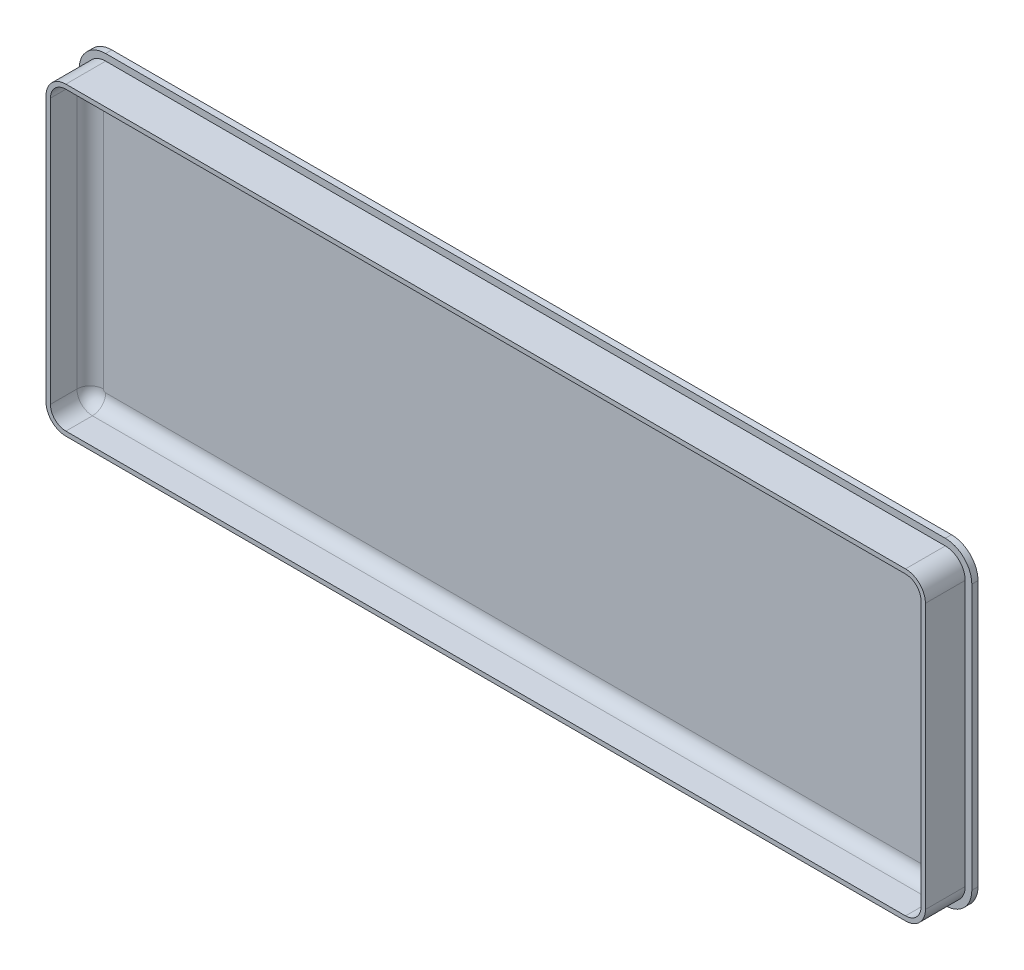
ISO-10303-21;
HEADER;
FILE_DESCRIPTION(('STEP AP214'),'2;1');
FILE_NAME('part.step','',(''),(''),'','','');
FILE_SCHEMA(('AUTOMOTIVE_DESIGN { 1 0 10303 214 1 1 1 1 }'));
ENDSEC;
DATA;
#1=APPLICATION_CONTEXT('core data for automotive mechanical design processes');
#2=APPLICATION_PROTOCOL_DEFINITION('international standard','automotive_design',2000,#1);
#3=PRODUCT_CONTEXT('',#1,'mechanical');
#4=PRODUCT('Part','Part','',(#3));
#5=PRODUCT_RELATED_PRODUCT_CATEGORY('part','',(#4));
#6=PRODUCT_DEFINITION_FORMATION('','',#4);
#7=PRODUCT_DEFINITION_CONTEXT('part definition',#1,'design');
#8=PRODUCT_DEFINITION('design','',#6,#7);
#9=PRODUCT_DEFINITION_SHAPE('','',#8);
#10=(LENGTH_UNIT() NAMED_UNIT(*) SI_UNIT(.MILLI.,.METRE.));
#11=(NAMED_UNIT(*) PLANE_ANGLE_UNIT() SI_UNIT($,.RADIAN.));
#12=(NAMED_UNIT(*) SI_UNIT($,.STERADIAN.) SOLID_ANGLE_UNIT());
#13=UNCERTAINTY_MEASURE_WITH_UNIT(LENGTH_MEASURE(1.E-05),#10,'distance_accuracy_value','');
#14=(GEOMETRIC_REPRESENTATION_CONTEXT(3) GLOBAL_UNCERTAINTY_ASSIGNED_CONTEXT((#13)) GLOBAL_UNIT_ASSIGNED_CONTEXT((#10,
#11,#12)) REPRESENTATION_CONTEXT('',''));
#15=CARTESIAN_POINT('',(0.,0.,0.));
#16=DIRECTION('',(0.,0.,1.));
#17=DIRECTION('',(1.,0.,0.));
#18=AXIS2_PLACEMENT_3D('',#15,#16,#17);
#19=CARTESIAN_POINT('',(0.,0.,1.4));
#20=DIRECTION('',(0.,0.,-1.));
#21=DIRECTION('',(-1.,0.,0.));
#22=AXIS2_PLACEMENT_3D('',#19,#20,#21);
#23=PLANE('',#22);
#24=DIRECTION('',(0.,1.,0.));
#25=VECTOR('',#24,1.);
#26=CARTESIAN_POINT('',(202.,0.,1.4));
#27=LINE('',#26,#25);
#28=CARTESIAN_POINT('',(202.,6.,1.4));
#29=VERTEX_POINT('',#28);
#30=CARTESIAN_POINT('',(202.,66.,1.4));
#31=VERTEX_POINT('',#30);
#32=EDGE_CURVE('E423',#29,#31,#27,.T.);
#33=ORIENTED_EDGE('',*,*,#32,.T.);
#34=CARTESIAN_POINT('',(196.,66.,1.4));
#35=DIRECTION('',(0.,0.,-1.));
#36=DIRECTION('',(-1.,0.,0.));
#37=AXIS2_PLACEMENT_3D('',#34,#35,#36);
#38=CIRCLE('',#37,6.);
#39=CARTESIAN_POINT('',(196.,72.,1.4));
#40=VERTEX_POINT('',#39);
#41=EDGE_CURVE('E317',#31,#40,#38,.F.);
#42=ORIENTED_EDGE('',*,*,#41,.T.);
#43=DIRECTION('',(-1.,0.,0.));
#44=VECTOR('',#43,1.);
#45=CARTESIAN_POINT('',(0.,72.,1.4));
#46=LINE('',#45,#44);
#47=CARTESIAN_POINT('',(6.,72.,1.4));
#48=VERTEX_POINT('',#47);
#49=EDGE_CURVE('E232',#40,#48,#46,.T.);
#50=ORIENTED_EDGE('',*,*,#49,.T.);
#51=CARTESIAN_POINT('',(6.,66.,1.4));
#52=DIRECTION('',(0.,0.,-1.));
#53=DIRECTION('',(-1.,0.,0.));
#54=AXIS2_PLACEMENT_3D('',#51,#52,#53);
#55=CIRCLE('',#54,6.);
#56=CARTESIAN_POINT('',(0.,66.,1.4));
#57=VERTEX_POINT('',#56);
#58=EDGE_CURVE('E313',#48,#57,#55,.F.);
#59=ORIENTED_EDGE('',*,*,#58,.T.);
#60=DIRECTION('',(0.,-1.,0.));
#61=VECTOR('',#60,1.);
#62=CARTESIAN_POINT('',(0.,0.,1.4));
#63=LINE('',#62,#61);
#64=CARTESIAN_POINT('',(0.,6.,1.4));
#65=VERTEX_POINT('',#64);
#66=EDGE_CURVE('E416',#57,#65,#63,.T.);
#67=ORIENTED_EDGE('',*,*,#66,.T.);
#68=CARTESIAN_POINT('',(6.,6.,1.4));
#69=DIRECTION('',(0.,0.,-1.));
#70=DIRECTION('',(-1.,0.,0.));
#71=AXIS2_PLACEMENT_3D('',#68,#69,#70);
#72=CIRCLE('',#71,6.);
#73=CARTESIAN_POINT('',(6.,0.,1.4));
#74=VERTEX_POINT('',#73);
#75=EDGE_CURVE('E311',#65,#74,#72,.F.);
#76=ORIENTED_EDGE('',*,*,#75,.T.);
#77=DIRECTION('',(1.,0.,0.));
#78=VECTOR('',#77,1.);
#79=CARTESIAN_POINT('',(0.,0.,1.4));
#80=LINE('',#79,#78);
#81=CARTESIAN_POINT('',(196.,0.,1.4));
#82=VERTEX_POINT('',#81);
#83=EDGE_CURVE('E419',#74,#82,#80,.T.);
#84=ORIENTED_EDGE('',*,*,#83,.T.);
#85=CARTESIAN_POINT('',(196.,6.,1.4));
#86=DIRECTION('',(0.,0.,-1.));
#87=DIRECTION('',(-1.,0.,0.));
#88=AXIS2_PLACEMENT_3D('',#85,#86,#87);
#89=CIRCLE('',#88,6.);
#90=EDGE_CURVE('E315',#82,#29,#89,.F.);
#91=ORIENTED_EDGE('',*,*,#90,.T.);
#92=EDGE_LOOP('',(#33,#42,#50,#59,#67,#76,#84,#91));
#93=FACE_BOUND('',#92,.T.);
#94=DIRECTION('',(0.,-1.,0.));
#95=VECTOR('',#94,1.);
#96=CARTESIAN_POINT('',(1.5,70.5,1.4));
#97=LINE('',#96,#95);
#98=CARTESIAN_POINT('',(1.5,66.,1.4));
#99=VERTEX_POINT('',#98);
#100=CARTESIAN_POINT('',(1.50000000000001,6.00000000000001,1.4));
#101=VERTEX_POINT('',#100);
#102=EDGE_CURVE('E243',#99,#101,#97,.T.);
#103=ORIENTED_EDGE('',*,*,#102,.F.);
#104=CARTESIAN_POINT('',(6.,66.,1.4));
#105=DIRECTION('',(0.,0.,-1.));
#106=DIRECTION('',(-1.,0.,0.));
#107=AXIS2_PLACEMENT_3D('',#104,#105,#106);
#108=CIRCLE('',#107,4.5);
#109=CARTESIAN_POINT('',(6.,70.5,1.4));
#110=VERTEX_POINT('',#109);
#111=EDGE_CURVE('E285',#99,#110,#108,.T.);
#112=ORIENTED_EDGE('',*,*,#111,.T.);
#113=DIRECTION('',(-1.,0.,0.));
#114=VECTOR('',#113,1.);
#115=CARTESIAN_POINT('',(1.5,70.5,1.4));
#116=LINE('',#115,#114);
#117=CARTESIAN_POINT('',(196.,70.5,1.4));
#118=VERTEX_POINT('',#117);
#119=EDGE_CURVE('E396',#118,#110,#116,.T.);
#120=ORIENTED_EDGE('',*,*,#119,.F.);
#121=CARTESIAN_POINT('',(196.,66.,1.4));
#122=DIRECTION('',(0.,0.,-1.));
#123=DIRECTION('',(-1.,0.,0.));
#124=AXIS2_PLACEMENT_3D('',#121,#122,#123);
#125=CIRCLE('',#124,4.5);
#126=CARTESIAN_POINT('',(200.5,66.,1.4));
#127=VERTEX_POINT('',#126);
#128=EDGE_CURVE('E289',#118,#127,#125,.T.);
#129=ORIENTED_EDGE('',*,*,#128,.T.);
#130=DIRECTION('',(0.,1.,0.));
#131=VECTOR('',#130,1.);
#132=CARTESIAN_POINT('',(200.5,70.5,1.4));
#133=LINE('',#132,#131);
#134=CARTESIAN_POINT('',(200.5,6.00000000000001,1.4));
#135=VERTEX_POINT('',#134);
#136=EDGE_CURVE('E411',#135,#127,#133,.T.);
#137=ORIENTED_EDGE('',*,*,#136,.F.);
#138=CARTESIAN_POINT('',(196.,6.00000000000001,1.4));
#139=DIRECTION('',(0.,0.,-1.));
#140=DIRECTION('',(-1.,0.,0.));
#141=AXIS2_PLACEMENT_3D('',#138,#139,#140);
#142=CIRCLE('',#141,4.5);
#143=CARTESIAN_POINT('',(196.,1.5,1.4));
#144=VERTEX_POINT('',#143);
#145=EDGE_CURVE('E291',#135,#144,#142,.T.);
#146=ORIENTED_EDGE('',*,*,#145,.T.);
#147=DIRECTION('',(1.,0.,0.));
#148=VECTOR('',#147,1.);
#149=CARTESIAN_POINT('',(1.50000000000001,1.5,1.4));
#150=LINE('',#149,#148);
#151=CARTESIAN_POINT('',(6.00000000000001,1.5,1.4));
#152=VERTEX_POINT('',#151);
#153=EDGE_CURVE('E408',#152,#144,#150,.T.);
#154=ORIENTED_EDGE('',*,*,#153,.F.);
#155=CARTESIAN_POINT('',(6.00000000000001,6.,1.4));
#156=DIRECTION('',(0.,0.,-1.));
#157=DIRECTION('',(-1.,0.,0.));
#158=AXIS2_PLACEMENT_3D('',#155,#156,#157);
#159=CIRCLE('',#158,4.5);
#160=EDGE_CURVE('E287',#152,#101,#159,.T.);
#161=ORIENTED_EDGE('',*,*,#160,.T.);
#162=EDGE_LOOP('',(#103,#112,#120,#129,#137,#146,#154,#161));
#163=FACE_BOUND('',#162,.T.);
#164=ADVANCED_FACE('F35',(#93,#163),#23,.F.);
#165=CARTESIAN_POINT('',(0.,0.,1.4));
#166=DIRECTION('',(1.,0.,0.));
#167=DIRECTION('',(0.,0.,-1.));
#168=AXIS2_PLACEMENT_3D('',#165,#166,#167);
#169=PLANE('',#168);
#170=ORIENTED_EDGE('',*,*,#66,.F.);
#171=DIRECTION('',(0.,0.,-1.));
#172=VECTOR('',#171,1.);
#173=CARTESIAN_POINT('',(0.,66.,1.4));
#174=LINE('',#173,#172);
#175=CARTESIAN_POINT('',(0.,66.,0.));
#176=VERTEX_POINT('',#175);
#177=EDGE_CURVE('E326',#57,#176,#174,.T.);
#178=ORIENTED_EDGE('',*,*,#177,.T.);
#179=DIRECTION('',(0.,-1.,0.));
#180=VECTOR('',#179,1.);
#181=CARTESIAN_POINT('',(0.,0.,0.));
#182=LINE('',#181,#180);
#183=CARTESIAN_POINT('',(0.,6.,0.));
#184=VERTEX_POINT('',#183);
#185=EDGE_CURVE('E405',#176,#184,#182,.T.);
#186=ORIENTED_EDGE('',*,*,#185,.T.);
#187=DIRECTION('',(0.,0.,-1.));
#188=VECTOR('',#187,1.);
#189=CARTESIAN_POINT('',(0.,6.,1.4));
#190=LINE('',#189,#188);
#191=EDGE_CURVE('E324',#184,#65,#190,.F.);
#192=ORIENTED_EDGE('',*,*,#191,.T.);
#193=EDGE_LOOP('',(#170,#178,#186,#192));
#194=FACE_BOUND('',#193,.T.);
#195=ADVANCED_FACE('F492',(#194),#169,.F.);
#196=CARTESIAN_POINT('',(0.,0.,1.4));
#197=DIRECTION('',(0.,1.,0.));
#198=DIRECTION('',(0.,0.,1.));
#199=AXIS2_PLACEMENT_3D('',#196,#197,#198);
#200=PLANE('',#199);
#201=DIRECTION('',(1.,0.,0.));
#202=VECTOR('',#201,1.);
#203=CARTESIAN_POINT('',(0.,0.,0.));
#204=LINE('',#203,#202);
#205=CARTESIAN_POINT('',(6.,0.,0.));
#206=VERTEX_POINT('',#205);
#207=CARTESIAN_POINT('',(196.,0.,0.));
#208=VERTEX_POINT('',#207);
#209=EDGE_CURVE('E430',#206,#208,#204,.T.);
#210=ORIENTED_EDGE('',*,*,#209,.T.);
#211=DIRECTION('',(0.,0.,-1.));
#212=VECTOR('',#211,1.);
#213=CARTESIAN_POINT('',(196.,0.,1.4));
#214=LINE('',#213,#212);
#215=EDGE_CURVE('E322',#208,#82,#214,.F.);
#216=ORIENTED_EDGE('',*,*,#215,.T.);
#217=ORIENTED_EDGE('',*,*,#83,.F.);
#218=DIRECTION('',(0.,0.,-1.));
#219=VECTOR('',#218,1.);
#220=CARTESIAN_POINT('',(6.,0.,1.4));
#221=LINE('',#220,#219);
#222=EDGE_CURVE('E319',#74,#206,#221,.T.);
#223=ORIENTED_EDGE('',*,*,#222,.T.);
#224=EDGE_LOOP('',(#210,#216,#217,#223));
#225=FACE_BOUND('',#224,.T.);
#226=ADVANCED_FACE('F498',(#225),#200,.F.);
#227=CARTESIAN_POINT('',(202.,0.,1.4));
#228=DIRECTION('',(-1.,0.,0.));
#229=DIRECTION('',(0.,0.,1.));
#230=AXIS2_PLACEMENT_3D('',#227,#228,#229);
#231=PLANE('',#230);
#232=DIRECTION('',(0.,1.,0.));
#233=VECTOR('',#232,1.);
#234=CARTESIAN_POINT('',(202.,0.,0.));
#235=LINE('',#234,#233);
#236=CARTESIAN_POINT('',(202.,6.,0.));
#237=VERTEX_POINT('',#236);
#238=CARTESIAN_POINT('',(202.,66.,0.));
#239=VERTEX_POINT('',#238);
#240=EDGE_CURVE('E433',#237,#239,#235,.T.);
#241=ORIENTED_EDGE('',*,*,#240,.T.);
#242=DIRECTION('',(0.,0.,-1.));
#243=VECTOR('',#242,1.);
#244=CARTESIAN_POINT('',(202.,66.,1.4));
#245=LINE('',#244,#243);
#246=EDGE_CURVE('E309',#239,#31,#245,.F.);
#247=ORIENTED_EDGE('',*,*,#246,.T.);
#248=ORIENTED_EDGE('',*,*,#32,.F.);
#249=DIRECTION('',(0.,0.,-1.));
#250=VECTOR('',#249,1.);
#251=CARTESIAN_POINT('',(202.,6.,1.4));
#252=LINE('',#251,#250);
#253=EDGE_CURVE('E306',#29,#237,#252,.T.);
#254=ORIENTED_EDGE('',*,*,#253,.T.);
#255=EDGE_LOOP('',(#241,#247,#248,#254));
#256=FACE_BOUND('',#255,.T.);
#257=ADVANCED_FACE('F594',(#256),#231,.F.);
#258=CARTESIAN_POINT('',(0.,72.,1.4));
#259=DIRECTION('',(0.,-1.,0.));
#260=DIRECTION('',(0.,0.,-1.));
#261=AXIS2_PLACEMENT_3D('',#258,#259,#260);
#262=PLANE('',#261);
#263=ORIENTED_EDGE('',*,*,#49,.F.);
#264=DIRECTION('',(0.,0.,-1.));
#265=VECTOR('',#264,1.);
#266=CARTESIAN_POINT('',(196.,72.,1.4));
#267=LINE('',#266,#265);
#268=CARTESIAN_POINT('',(196.,72.,0.));
#269=VERTEX_POINT('',#268);
#270=EDGE_CURVE('E295',#40,#269,#267,.T.);
#271=ORIENTED_EDGE('',*,*,#270,.T.);
#272=DIRECTION('',(-1.,0.,0.));
#273=VECTOR('',#272,1.);
#274=CARTESIAN_POINT('',(0.,72.,0.));
#275=LINE('',#274,#273);
#276=CARTESIAN_POINT('',(6.,72.,0.));
#277=VERTEX_POINT('',#276);
#278=EDGE_CURVE('E420',#269,#277,#275,.T.);
#279=ORIENTED_EDGE('',*,*,#278,.T.);
#280=DIRECTION('',(0.,0.,-1.));
#281=VECTOR('',#280,1.);
#282=CARTESIAN_POINT('',(6.,72.,1.4));
#283=LINE('',#282,#281);
#284=EDGE_CURVE('E293',#277,#48,#283,.F.);
#285=ORIENTED_EDGE('',*,*,#284,.T.);
#286=EDGE_LOOP('',(#263,#271,#279,#285));
#287=FACE_BOUND('',#286,.T.);
#288=ADVANCED_FACE('F582',(#287),#262,.F.);
#289=CARTESIAN_POINT('',(0.,0.,0.));
#290=DIRECTION('',(0.,0.,-1.));
#291=DIRECTION('',(-1.,0.,0.));
#292=AXIS2_PLACEMENT_3D('',#289,#290,#291);
#293=PLANE('',#292);
#294=ORIENTED_EDGE('',*,*,#278,.F.);
#295=CARTESIAN_POINT('',(196.,66.,0.));
#296=DIRECTION('',(0.,0.,-1.));
#297=DIRECTION('',(-1.,0.,0.));
#298=AXIS2_PLACEMENT_3D('',#295,#296,#297);
#299=CIRCLE('',#298,6.);
#300=EDGE_CURVE('E304',#269,#239,#299,.T.);
#301=ORIENTED_EDGE('',*,*,#300,.T.);
#302=ORIENTED_EDGE('',*,*,#240,.F.);
#303=CARTESIAN_POINT('',(196.,6.,0.));
#304=DIRECTION('',(0.,0.,-1.));
#305=DIRECTION('',(-1.,0.,0.));
#306=AXIS2_PLACEMENT_3D('',#303,#304,#305);
#307=CIRCLE('',#306,6.);
#308=EDGE_CURVE('E302',#237,#208,#307,.T.);
#309=ORIENTED_EDGE('',*,*,#308,.T.);
#310=ORIENTED_EDGE('',*,*,#209,.F.);
#311=CARTESIAN_POINT('',(6.,6.,0.));
#312=DIRECTION('',(0.,0.,-1.));
#313=DIRECTION('',(-1.,0.,0.));
#314=AXIS2_PLACEMENT_3D('',#311,#312,#313);
#315=CIRCLE('',#314,6.);
#316=EDGE_CURVE('E298',#206,#184,#315,.T.);
#317=ORIENTED_EDGE('',*,*,#316,.T.);
#318=ORIENTED_EDGE('',*,*,#185,.F.);
#319=CARTESIAN_POINT('',(6.,66.,0.));
#320=DIRECTION('',(0.,0.,-1.));
#321=DIRECTION('',(-1.,0.,0.));
#322=AXIS2_PLACEMENT_3D('',#319,#320,#321);
#323=CIRCLE('',#322,6.);
#324=EDGE_CURVE('E300',#176,#277,#323,.T.);
#325=ORIENTED_EDGE('',*,*,#324,.T.);
#326=EDGE_LOOP('',(#294,#301,#302,#309,#310,#317,#318,#325));
#327=FACE_BOUND('',#326,.T.);
#328=ADVANCED_FACE('F577',(#327),#293,.T.);
#329=CARTESIAN_POINT('',(0.,0.,10.4));
#330=DIRECTION('',(0.,0.,1.));
#331=DIRECTION('',(1.,0.,0.));
#332=AXIS2_PLACEMENT_3D('',#329,#330,#331);
#333=PLANE('',#332);
#334=DIRECTION('',(-1.,0.,0.));
#335=VECTOR('',#334,1.);
#336=CARTESIAN_POINT('',(1.5,70.5,10.4));
#337=LINE('',#336,#335);
#338=CARTESIAN_POINT('',(196.,70.5,10.4));
#339=VERTEX_POINT('',#338);
#340=CARTESIAN_POINT('',(6.,70.5,10.4));
#341=VERTEX_POINT('',#340);
#342=EDGE_CURVE('E402',#339,#341,#337,.T.);
#343=ORIENTED_EDGE('',*,*,#342,.T.);
#344=CARTESIAN_POINT('',(6.,66.,10.4));
#345=DIRECTION('',(0.,0.,1.));
#346=DIRECTION('',(1.,0.,0.));
#347=AXIS2_PLACEMENT_3D('',#344,#345,#346);
#348=CIRCLE('',#347,4.5);
#349=CARTESIAN_POINT('',(1.5,66.,10.4));
#350=VERTEX_POINT('',#349);
#351=EDGE_CURVE('E273',#341,#350,#348,.T.);
#352=ORIENTED_EDGE('',*,*,#351,.T.);
#353=DIRECTION('',(0.,-1.,0.));
#354=VECTOR('',#353,1.);
#355=CARTESIAN_POINT('',(1.5,70.5,10.4));
#356=LINE('',#355,#354);
#357=CARTESIAN_POINT('',(1.50000000000001,6.00000000000001,10.4));
#358=VERTEX_POINT('',#357);
#359=EDGE_CURVE('E392',#350,#358,#356,.T.);
#360=ORIENTED_EDGE('',*,*,#359,.T.);
#361=CARTESIAN_POINT('',(6.00000000000001,6.,10.4));
#362=DIRECTION('',(0.,0.,1.));
#363=DIRECTION('',(1.,0.,0.));
#364=AXIS2_PLACEMENT_3D('',#361,#362,#363);
#365=CIRCLE('',#364,4.5);
#366=CARTESIAN_POINT('',(6.00000000000001,1.5,10.4));
#367=VERTEX_POINT('',#366);
#368=EDGE_CURVE('E271',#358,#367,#365,.T.);
#369=ORIENTED_EDGE('',*,*,#368,.T.);
#370=DIRECTION('',(1.,0.,0.));
#371=VECTOR('',#370,1.);
#372=CARTESIAN_POINT('',(1.50000000000001,1.5,10.4));
#373=LINE('',#372,#371);
#374=CARTESIAN_POINT('',(196.,1.5,10.4));
#375=VERTEX_POINT('',#374);
#376=EDGE_CURVE('E395',#367,#375,#373,.T.);
#377=ORIENTED_EDGE('',*,*,#376,.T.);
#378=CARTESIAN_POINT('',(196.,6.00000000000001,10.4));
#379=DIRECTION('',(0.,0.,1.));
#380=DIRECTION('',(1.,0.,0.));
#381=AXIS2_PLACEMENT_3D('',#378,#379,#380);
#382=CIRCLE('',#381,4.5);
#383=CARTESIAN_POINT('',(200.5,6.00000000000001,10.4));
#384=VERTEX_POINT('',#383);
#385=EDGE_CURVE('E267',#375,#384,#382,.T.);
#386=ORIENTED_EDGE('',*,*,#385,.T.);
#387=DIRECTION('',(0.,1.,0.));
#388=VECTOR('',#387,1.);
#389=CARTESIAN_POINT('',(200.5,70.5,10.4));
#390=LINE('',#389,#388);
#391=CARTESIAN_POINT('',(200.5,66.,10.4));
#392=VERTEX_POINT('',#391);
#393=EDGE_CURVE('E399',#384,#392,#390,.T.);
#394=ORIENTED_EDGE('',*,*,#393,.T.);
#395=CARTESIAN_POINT('',(196.,66.,10.4));
#396=DIRECTION('',(0.,0.,1.));
#397=DIRECTION('',(1.,0.,0.));
#398=AXIS2_PLACEMENT_3D('',#395,#396,#397);
#399=CIRCLE('',#398,4.5);
#400=EDGE_CURVE('E269',#392,#339,#399,.T.);
#401=ORIENTED_EDGE('',*,*,#400,.T.);
#402=EDGE_LOOP('',(#343,#352,#360,#369,#377,#386,#394,#401));
#403=FACE_BOUND('',#402,.T.);
#404=DIRECTION('',(1.,0.,0.));
#405=VECTOR('',#404,1.);
#406=CARTESIAN_POINT('',(2.50000000000001,2.5,10.4));
#407=LINE('',#406,#405);
#408=CARTESIAN_POINT('',(6.00000000000001,2.5,10.4));
#409=VERTEX_POINT('',#408);
#410=CARTESIAN_POINT('',(196.,2.5,10.4));
#411=VERTEX_POINT('',#410);
#412=EDGE_CURVE('E385',#409,#411,#407,.T.);
#413=ORIENTED_EDGE('',*,*,#412,.F.);
#414=CARTESIAN_POINT('',(6.00000000000001,5.99999999999999,10.4));
#415=DIRECTION('',(0.,0.,1.));
#416=DIRECTION('',(1.,0.,0.));
#417=AXIS2_PLACEMENT_3D('',#414,#415,#416);
#418=CIRCLE('',#417,3.5);
#419=CARTESIAN_POINT('',(2.50000000000001,5.99999999999999,10.4));
#420=VERTEX_POINT('',#419);
#421=EDGE_CURVE('E251',#409,#420,#418,.F.);
#422=ORIENTED_EDGE('',*,*,#421,.T.);
#423=DIRECTION('',(0.,-1.,0.));
#424=VECTOR('',#423,1.);
#425=CARTESIAN_POINT('',(2.5,69.5,10.4));
#426=LINE('',#425,#424);
#427=CARTESIAN_POINT('',(2.5,66.,10.4));
#428=VERTEX_POINT('',#427);
#429=EDGE_CURVE('E379',#428,#420,#426,.T.);
#430=ORIENTED_EDGE('',*,*,#429,.F.);
#431=CARTESIAN_POINT('',(6.,66.,10.4));
#432=DIRECTION('',(0.,0.,1.));
#433=DIRECTION('',(1.,0.,0.));
#434=AXIS2_PLACEMENT_3D('',#431,#432,#433);
#435=CIRCLE('',#434,3.5);
#436=CARTESIAN_POINT('',(6.,69.5,10.4));
#437=VERTEX_POINT('',#436);
#438=EDGE_CURVE('E242',#428,#437,#435,.F.);
#439=ORIENTED_EDGE('',*,*,#438,.T.);
#440=DIRECTION('',(-1.,0.,0.));
#441=VECTOR('',#440,1.);
#442=CARTESIAN_POINT('',(2.5,69.5,10.4));
#443=LINE('',#442,#441);
#444=CARTESIAN_POINT('',(196.,69.5,10.4));
#445=VERTEX_POINT('',#444);
#446=EDGE_CURVE('E225',#445,#437,#443,.T.);
#447=ORIENTED_EDGE('',*,*,#446,.F.);
#448=CARTESIAN_POINT('',(196.,66.,10.4));
#449=DIRECTION('',(0.,0.,1.));
#450=DIRECTION('',(1.,0.,0.));
#451=AXIS2_PLACEMENT_3D('',#448,#449,#450);
#452=CIRCLE('',#451,3.5);
#453=CARTESIAN_POINT('',(199.5,66.,10.4));
#454=VERTEX_POINT('',#453);
#455=EDGE_CURVE('E238',#445,#454,#452,.F.);
#456=ORIENTED_EDGE('',*,*,#455,.T.);
#457=DIRECTION('',(0.,1.,0.));
#458=VECTOR('',#457,1.);
#459=CARTESIAN_POINT('',(199.5,69.5,10.4));
#460=LINE('',#459,#458);
#461=CARTESIAN_POINT('',(199.5,6.00000000000001,10.4));
#462=VERTEX_POINT('',#461);
#463=EDGE_CURVE('E244',#462,#454,#460,.T.);
#464=ORIENTED_EDGE('',*,*,#463,.F.);
#465=CARTESIAN_POINT('',(196.,6.,10.4));
#466=DIRECTION('',(0.,0.,1.));
#467=DIRECTION('',(1.,0.,0.));
#468=AXIS2_PLACEMENT_3D('',#465,#466,#467);
#469=CIRCLE('',#468,3.5);
#470=EDGE_CURVE('E250',#462,#411,#469,.F.);
#471=ORIENTED_EDGE('',*,*,#470,.T.);
#472=EDGE_LOOP('',(#413,#422,#430,#439,#447,#456,#464,#471));
#473=FACE_BOUND('',#472,.T.);
#474=ADVANCED_FACE('F236',(#403,#473),#333,.T.);
#475=CARTESIAN_POINT('',(1.5,70.5,10.4));
#476=DIRECTION('',(1.,0.,0.));
#477=DIRECTION('',(0.,1.,0.));
#478=AXIS2_PLACEMENT_3D('',#475,#476,#477);
#479=PLANE('',#478);
#480=ORIENTED_EDGE('',*,*,#359,.F.);
#481=DIRECTION('',(0.,0.,-1.));
#482=VECTOR('',#481,1.);
#483=CARTESIAN_POINT('',(1.5,66.,10.4));
#484=LINE('',#483,#482);
#485=EDGE_CURVE('E259',#350,#99,#484,.T.);
#486=ORIENTED_EDGE('',*,*,#485,.T.);
#487=ORIENTED_EDGE('',*,*,#102,.T.);
#488=DIRECTION('',(0.,0.,-1.));
#489=VECTOR('',#488,1.);
#490=CARTESIAN_POINT('',(1.50000000000001,6.00000000000001,10.4));
#491=LINE('',#490,#489);
#492=EDGE_CURVE('E253',#101,#358,#491,.F.);
#493=ORIENTED_EDGE('',*,*,#492,.T.);
#494=EDGE_LOOP('',(#480,#486,#487,#493));
#495=FACE_BOUND('',#494,.T.);
#496=ADVANCED_FACE('F686',(#495),#479,.F.);
#497=CARTESIAN_POINT('',(1.50000000000001,1.5,10.4));
#498=DIRECTION('',(0.,1.,0.));
#499=DIRECTION('',(-1.,0.,0.));
#500=AXIS2_PLACEMENT_3D('',#497,#498,#499);
#501=PLANE('',#500);
#502=ORIENTED_EDGE('',*,*,#376,.F.);
#503=DIRECTION('',(0.,0.,-1.));
#504=VECTOR('',#503,1.);
#505=CARTESIAN_POINT('',(6.00000000000001,1.5,10.4));
#506=LINE('',#505,#504);
#507=EDGE_CURVE('E277',#367,#152,#506,.T.);
#508=ORIENTED_EDGE('',*,*,#507,.T.);
#509=ORIENTED_EDGE('',*,*,#153,.T.);
#510=DIRECTION('',(0.,0.,-1.));
#511=VECTOR('',#510,1.);
#512=CARTESIAN_POINT('',(196.,1.5,10.4));
#513=LINE('',#512,#511);
#514=EDGE_CURVE('E275',#144,#375,#513,.F.);
#515=ORIENTED_EDGE('',*,*,#514,.T.);
#516=EDGE_LOOP('',(#502,#508,#509,#515));
#517=FACE_BOUND('',#516,.T.);
#518=ADVANCED_FACE('F676',(#517),#501,.F.);
#519=CARTESIAN_POINT('',(200.5,70.5,10.4));
#520=DIRECTION('',(-1.,0.,0.));
#521=DIRECTION('',(0.,0.,1.));
#522=AXIS2_PLACEMENT_3D('',#519,#520,#521);
#523=PLANE('',#522);
#524=ORIENTED_EDGE('',*,*,#136,.T.);
#525=DIRECTION('',(0.,0.,-1.));
#526=VECTOR('',#525,1.);
#527=CARTESIAN_POINT('',(200.5,66.,10.4));
#528=LINE('',#527,#526);
#529=EDGE_CURVE('E283',#127,#392,#528,.F.);
#530=ORIENTED_EDGE('',*,*,#529,.T.);
#531=ORIENTED_EDGE('',*,*,#393,.F.);
#532=DIRECTION('',(0.,0.,-1.));
#533=VECTOR('',#532,1.);
#534=CARTESIAN_POINT('',(200.5,6.00000000000001,10.4));
#535=LINE('',#534,#533);
#536=EDGE_CURVE('E280',#384,#135,#535,.T.);
#537=ORIENTED_EDGE('',*,*,#536,.T.);
#538=EDGE_LOOP('',(#524,#530,#531,#537));
#539=FACE_BOUND('',#538,.T.);
#540=ADVANCED_FACE('F487',(#539),#523,.F.);
#541=CARTESIAN_POINT('',(1.5,70.5,10.4));
#542=DIRECTION('',(0.,-1.,0.));
#543=DIRECTION('',(0.,0.,-1.));
#544=AXIS2_PLACEMENT_3D('',#541,#542,#543);
#545=PLANE('',#544);
#546=ORIENTED_EDGE('',*,*,#119,.T.);
#547=DIRECTION('',(0.,0.,-1.));
#548=VECTOR('',#547,1.);
#549=CARTESIAN_POINT('',(6.,70.5,10.4));
#550=LINE('',#549,#548);
#551=EDGE_CURVE('E265',#110,#341,#550,.F.);
#552=ORIENTED_EDGE('',*,*,#551,.T.);
#553=ORIENTED_EDGE('',*,*,#342,.F.);
#554=DIRECTION('',(0.,0.,-1.));
#555=VECTOR('',#554,1.);
#556=CARTESIAN_POINT('',(196.,70.5,10.4));
#557=LINE('',#556,#555);
#558=EDGE_CURVE('E262',#339,#118,#557,.T.);
#559=ORIENTED_EDGE('',*,*,#558,.T.);
#560=EDGE_LOOP('',(#546,#552,#553,#559));
#561=FACE_BOUND('',#560,.T.);
#562=ADVANCED_FACE('F480',(#561),#545,.F.);
#563=CARTESIAN_POINT('',(2.5,69.5,10.4));
#564=DIRECTION('',(1.,0.,0.));
#565=DIRECTION('',(0.,1.,0.));
#566=AXIS2_PLACEMENT_3D('',#563,#564,#565);
#567=PLANE('',#566);
#568=DIRECTION('',(0.,0.,-1.));
#569=VECTOR('',#568,1.);
#570=CARTESIAN_POINT('',(2.50000000000001,5.99999999999999,1.4));
#571=LINE('',#570,#569);
#572=CARTESIAN_POINT('',(2.50000000000001,5.99999999999999,4.4));
#573=VERTEX_POINT('',#572);
#574=EDGE_CURVE('E439',#420,#573,#571,.T.);
#575=ORIENTED_EDGE('',*,*,#574,.T.);
#576=DIRECTION('',(0.,-1.,0.));
#577=VECTOR('',#576,1.);
#578=CARTESIAN_POINT('',(2.5,69.5,4.4));
#579=LINE('',#578,#577);
#580=CARTESIAN_POINT('',(2.5,66.,4.4));
#581=VERTEX_POINT('',#580);
#582=EDGE_CURVE('E59',#573,#581,#579,.F.);
#583=ORIENTED_EDGE('',*,*,#582,.T.);
#584=DIRECTION('',(0.,0.,-1.));
#585=VECTOR('',#584,1.);
#586=CARTESIAN_POINT('',(2.5,66.,10.4));
#587=LINE('',#586,#585);
#588=EDGE_CURVE('E441',#581,#428,#587,.F.);
#589=ORIENTED_EDGE('',*,*,#588,.T.);
#590=ORIENTED_EDGE('',*,*,#429,.T.);
#591=EDGE_LOOP('',(#575,#583,#589,#590));
#592=FACE_BOUND('',#591,.T.);
#593=ADVANCED_FACE('F478',(#592),#567,.T.);
#594=CARTESIAN_POINT('',(2.50000000000001,2.5,10.4));
#595=DIRECTION('',(0.,1.,0.));
#596=DIRECTION('',(-1.,0.,0.));
#597=AXIS2_PLACEMENT_3D('',#594,#595,#596);
#598=PLANE('',#597);
#599=DIRECTION('',(0.,0.,-1.));
#600=VECTOR('',#599,1.);
#601=CARTESIAN_POINT('',(196.,2.5,1.4));
#602=LINE('',#601,#600);
#603=CARTESIAN_POINT('',(196.,2.5,4.4));
#604=VERTEX_POINT('',#603);
#605=EDGE_CURVE('E443',#411,#604,#602,.T.);
#606=ORIENTED_EDGE('',*,*,#605,.T.);
#607=DIRECTION('',(1.,0.,0.));
#608=VECTOR('',#607,1.);
#609=CARTESIAN_POINT('',(2.50000000000001,2.5,4.4));
#610=LINE('',#609,#608);
#611=CARTESIAN_POINT('',(6.00000000000001,2.5,4.4));
#612=VERTEX_POINT('',#611);
#613=EDGE_CURVE('E352',#604,#612,#610,.F.);
#614=ORIENTED_EDGE('',*,*,#613,.T.);
#615=DIRECTION('',(0.,0.,-1.));
#616=VECTOR('',#615,1.);
#617=CARTESIAN_POINT('',(6.00000000000001,2.5,10.4));
#618=LINE('',#617,#616);
#619=EDGE_CURVE('E446',#612,#409,#618,.F.);
#620=ORIENTED_EDGE('',*,*,#619,.T.);
#621=ORIENTED_EDGE('',*,*,#412,.T.);
#622=EDGE_LOOP('',(#606,#614,#620,#621));
#623=FACE_BOUND('',#622,.T.);
#624=ADVANCED_FACE('F460',(#623),#598,.T.);
#625=CARTESIAN_POINT('',(199.5,69.5,10.4));
#626=DIRECTION('',(-1.,0.,0.));
#627=DIRECTION('',(0.,0.,1.));
#628=AXIS2_PLACEMENT_3D('',#625,#626,#627);
#629=PLANE('',#628);
#630=DIRECTION('',(0.,0.,-1.));
#631=VECTOR('',#630,1.);
#632=CARTESIAN_POINT('',(199.5,66.,1.4));
#633=LINE('',#632,#631);
#634=CARTESIAN_POINT('',(199.5,66.,4.4));
#635=VERTEX_POINT('',#634);
#636=EDGE_CURVE('E249',#454,#635,#633,.T.);
#637=ORIENTED_EDGE('',*,*,#636,.T.);
#638=DIRECTION('',(0.,1.,0.));
#639=VECTOR('',#638,1.);
#640=CARTESIAN_POINT('',(199.5,69.5,4.4));
#641=LINE('',#640,#639);
#642=CARTESIAN_POINT('',(199.5,6.,4.4));
#643=VERTEX_POINT('',#642);
#644=EDGE_CURVE('E348',#635,#643,#641,.F.);
#645=ORIENTED_EDGE('',*,*,#644,.T.);
#646=DIRECTION('',(0.,0.,-1.));
#647=VECTOR('',#646,1.);
#648=CARTESIAN_POINT('',(199.5,6.,10.4));
#649=LINE('',#648,#647);
#650=EDGE_CURVE('E448',#643,#462,#649,.F.);
#651=ORIENTED_EDGE('',*,*,#650,.T.);
#652=ORIENTED_EDGE('',*,*,#463,.T.);
#653=EDGE_LOOP('',(#637,#645,#651,#652));
#654=FACE_BOUND('',#653,.T.);
#655=ADVANCED_FACE('F451',(#654),#629,.T.);
#656=CARTESIAN_POINT('',(2.5,69.5,10.4));
#657=DIRECTION('',(0.,-1.,0.));
#658=DIRECTION('',(0.,0.,-1.));
#659=AXIS2_PLACEMENT_3D('',#656,#657,#658);
#660=PLANE('',#659);
#661=DIRECTION('',(0.,0.,-1.));
#662=VECTOR('',#661,1.);
#663=CARTESIAN_POINT('',(6.,69.5,1.4));
#664=LINE('',#663,#662);
#665=CARTESIAN_POINT('',(6.,69.5,4.4));
#666=VERTEX_POINT('',#665);
#667=EDGE_CURVE('E231',#437,#666,#664,.T.);
#668=ORIENTED_EDGE('',*,*,#667,.T.);
#669=DIRECTION('',(-1.,0.,0.));
#670=VECTOR('',#669,1.);
#671=CARTESIAN_POINT('',(2.5,69.5,4.4));
#672=LINE('',#671,#670);
#673=CARTESIAN_POINT('',(196.,69.5,4.4));
#674=VERTEX_POINT('',#673);
#675=EDGE_CURVE('E11',#666,#674,#672,.F.);
#676=ORIENTED_EDGE('',*,*,#675,.T.);
#677=DIRECTION('',(0.,0.,-1.));
#678=VECTOR('',#677,1.);
#679=CARTESIAN_POINT('',(196.,69.5,10.4));
#680=LINE('',#679,#678);
#681=EDGE_CURVE('E222',#674,#445,#680,.F.);
#682=ORIENTED_EDGE('',*,*,#681,.T.);
#683=ORIENTED_EDGE('',*,*,#446,.T.);
#684=EDGE_LOOP('',(#668,#676,#682,#683));
#685=FACE_BOUND('',#684,.T.);
#686=ADVANCED_FACE('F224',(#685),#660,.T.);
#687=DIRECTION('',(0.,1.,0.));
#688=VECTOR('',#687,1.);
#689=CARTESIAN_POINT('',(196.5,0.,1.4));
#690=LINE('',#689,#688);
#691=CARTESIAN_POINT('',(196.5,6.,1.4));
#692=VERTEX_POINT('',#691);
#693=CARTESIAN_POINT('',(196.5,66.,1.4));
#694=VERTEX_POINT('',#693);
#695=EDGE_CURVE('E341',#692,#694,#690,.T.);
#696=ORIENTED_EDGE('',*,*,#695,.T.);
#697=CARTESIAN_POINT('',(196.,66.,1.4));
#698=DIRECTION('',(0.,0.,-1.));
#699=DIRECTION('',(-1.,0.,0.));
#700=AXIS2_PLACEMENT_3D('',#697,#698,#699);
#701=CIRCLE('',#700,0.5);
#702=CARTESIAN_POINT('',(196.,66.5,1.4));
#703=VERTEX_POINT('',#702);
#704=EDGE_CURVE('E343',#694,#703,#701,.F.);
#705=ORIENTED_EDGE('',*,*,#704,.T.);
#706=DIRECTION('',(-1.,0.,0.));
#707=VECTOR('',#706,1.);
#708=CARTESIAN_POINT('',(0.,66.5,1.4));
#709=LINE('',#708,#707);
#710=CARTESIAN_POINT('',(6.,66.5,1.4));
#711=VERTEX_POINT('',#710);
#712=EDGE_CURVE('E329',#703,#711,#709,.T.);
#713=ORIENTED_EDGE('',*,*,#712,.T.);
#714=CARTESIAN_POINT('',(6.,66.,1.4));
#715=DIRECTION('',(0.,0.,-1.));
#716=DIRECTION('',(-1.,0.,0.));
#717=AXIS2_PLACEMENT_3D('',#714,#715,#716);
#718=CIRCLE('',#717,0.5);
#719=CARTESIAN_POINT('',(5.5,66.,1.4));
#720=VERTEX_POINT('',#719);
#721=EDGE_CURVE('E331',#711,#720,#718,.F.);
#722=ORIENTED_EDGE('',*,*,#721,.T.);
#723=DIRECTION('',(0.,-1.,0.));
#724=VECTOR('',#723,1.);
#725=CARTESIAN_POINT('',(5.50000000000001,0.,1.4));
#726=LINE('',#725,#724);
#727=CARTESIAN_POINT('',(5.50000000000001,5.99999999999999,1.4));
#728=VERTEX_POINT('',#727);
#729=EDGE_CURVE('E333',#720,#728,#726,.T.);
#730=ORIENTED_EDGE('',*,*,#729,.T.);
#731=CARTESIAN_POINT('',(6.00000000000001,5.99999999999999,1.4));
#732=DIRECTION('',(0.,0.,-1.));
#733=DIRECTION('',(-1.,0.,0.));
#734=AXIS2_PLACEMENT_3D('',#731,#732,#733);
#735=CIRCLE('',#734,0.5);
#736=CARTESIAN_POINT('',(6.00000000000001,5.49999999999999,1.4));
#737=VERTEX_POINT('',#736);
#738=EDGE_CURVE('E335',#728,#737,#735,.F.);
#739=ORIENTED_EDGE('',*,*,#738,.T.);
#740=DIRECTION('',(1.,0.,0.));
#741=VECTOR('',#740,1.);
#742=CARTESIAN_POINT('',(0.,5.5,1.4));
#743=LINE('',#742,#741);
#744=CARTESIAN_POINT('',(196.,5.5,1.4));
#745=VERTEX_POINT('',#744);
#746=EDGE_CURVE('E337',#737,#745,#743,.T.);
#747=ORIENTED_EDGE('',*,*,#746,.T.);
#748=CARTESIAN_POINT('',(196.,6.,1.4));
#749=DIRECTION('',(0.,0.,-1.));
#750=DIRECTION('',(-1.,0.,0.));
#751=AXIS2_PLACEMENT_3D('',#748,#749,#750);
#752=CIRCLE('',#751,0.5);
#753=EDGE_CURVE('E339',#745,#692,#752,.F.);
#754=ORIENTED_EDGE('',*,*,#753,.T.);
#755=EDGE_LOOP('',(#696,#705,#713,#722,#730,#739,#747,#754));
#756=FACE_BOUND('',#755,.T.);
#757=ADVANCED_FACE('F470',(#756),#23,.F.);
#758=CARTESIAN_POINT('',(6.,66.,10.4));
#759=DIRECTION('',(0.,0.,1.));
#760=DIRECTION('',(1.,0.,0.));
#761=AXIS2_PLACEMENT_3D('',#758,#759,#760);
#762=CYLINDRICAL_SURFACE('',#761,3.5);
#763=ORIENTED_EDGE('',*,*,#588,.F.);
#764=CARTESIAN_POINT('',(6.,66.,4.4));
#765=DIRECTION('',(0.,0.,-1.));
#766=DIRECTION('',(-1.,0.,0.));
#767=AXIS2_PLACEMENT_3D('',#764,#765,#766);
#768=CIRCLE('',#767,3.5);
#769=EDGE_CURVE('E44',#581,#666,#768,.T.);
#770=ORIENTED_EDGE('',*,*,#769,.T.);
#771=ORIENTED_EDGE('',*,*,#667,.F.);
#772=ORIENTED_EDGE('',*,*,#438,.F.);
#773=EDGE_LOOP('',(#763,#770,#771,#772));
#774=FACE_BOUND('',#773,.T.);
#775=ADVANCED_FACE('F505',(#774),#762,.F.);
#776=CARTESIAN_POINT('',(6.00000000000001,5.99999999999999,10.4));
#777=DIRECTION('',(0.,0.,1.));
#778=DIRECTION('',(1.,0.,0.));
#779=AXIS2_PLACEMENT_3D('',#776,#777,#778);
#780=CYLINDRICAL_SURFACE('',#779,3.5);
#781=ORIENTED_EDGE('',*,*,#619,.F.);
#782=CARTESIAN_POINT('',(6.00000000000001,5.99999999999999,4.4));
#783=DIRECTION('',(0.,0.,-1.));
#784=DIRECTION('',(-1.,0.,0.));
#785=AXIS2_PLACEMENT_3D('',#782,#783,#784);
#786=CIRCLE('',#785,3.5);
#787=EDGE_CURVE('E354',#612,#573,#786,.T.);
#788=ORIENTED_EDGE('',*,*,#787,.T.);
#789=ORIENTED_EDGE('',*,*,#574,.F.);
#790=ORIENTED_EDGE('',*,*,#421,.F.);
#791=EDGE_LOOP('',(#781,#788,#789,#790));
#792=FACE_BOUND('',#791,.T.);
#793=ADVANCED_FACE('F476',(#792),#780,.F.);
#794=CARTESIAN_POINT('',(196.,66.,10.4));
#795=DIRECTION('',(0.,0.,1.));
#796=DIRECTION('',(1.,0.,0.));
#797=AXIS2_PLACEMENT_3D('',#794,#795,#796);
#798=CYLINDRICAL_SURFACE('',#797,3.5);
#799=ORIENTED_EDGE('',*,*,#681,.F.);
#800=CARTESIAN_POINT('',(196.,66.,4.4));
#801=DIRECTION('',(0.,0.,-1.));
#802=DIRECTION('',(-1.,0.,0.));
#803=AXIS2_PLACEMENT_3D('',#800,#801,#802);
#804=CIRCLE('',#803,3.5);
#805=EDGE_CURVE('E346',#674,#635,#804,.T.);
#806=ORIENTED_EDGE('',*,*,#805,.T.);
#807=ORIENTED_EDGE('',*,*,#636,.F.);
#808=ORIENTED_EDGE('',*,*,#455,.F.);
#809=EDGE_LOOP('',(#799,#806,#807,#808));
#810=FACE_BOUND('',#809,.T.);
#811=ADVANCED_FACE('F247',(#810),#798,.F.);
#812=CARTESIAN_POINT('',(196.,6.,10.4));
#813=DIRECTION('',(0.,0.,1.));
#814=DIRECTION('',(1.,0.,0.));
#815=AXIS2_PLACEMENT_3D('',#812,#813,#814);
#816=CYLINDRICAL_SURFACE('',#815,3.5);
#817=ORIENTED_EDGE('',*,*,#650,.F.);
#818=CARTESIAN_POINT('',(196.,6.,4.4));
#819=DIRECTION('',(0.,0.,-1.));
#820=DIRECTION('',(-1.,0.,0.));
#821=AXIS2_PLACEMENT_3D('',#818,#819,#820);
#822=CIRCLE('',#821,3.5);
#823=EDGE_CURVE('E350',#643,#604,#822,.T.);
#824=ORIENTED_EDGE('',*,*,#823,.T.);
#825=ORIENTED_EDGE('',*,*,#605,.F.);
#826=ORIENTED_EDGE('',*,*,#470,.F.);
#827=EDGE_LOOP('',(#817,#824,#825,#826));
#828=FACE_BOUND('',#827,.T.);
#829=ADVANCED_FACE('F457',(#828),#816,.F.);
#830=CARTESIAN_POINT('',(6.,66.,10.4));
#831=DIRECTION('',(0.,0.,-1.));
#832=DIRECTION('',(-1.,0.,0.));
#833=AXIS2_PLACEMENT_3D('',#830,#831,#832);
#834=CYLINDRICAL_SURFACE('',#833,4.5);
#835=ORIENTED_EDGE('',*,*,#351,.F.);
#836=ORIENTED_EDGE('',*,*,#551,.F.);
#837=ORIENTED_EDGE('',*,*,#111,.F.);
#838=ORIENTED_EDGE('',*,*,#485,.F.);
#839=EDGE_LOOP('',(#835,#836,#837,#838));
#840=FACE_BOUND('',#839,.T.);
#841=ADVANCED_FACE('F650',(#840),#834,.T.);
#842=CARTESIAN_POINT('',(6.00000000000001,6.,10.4));
#843=DIRECTION('',(0.,0.,-1.));
#844=DIRECTION('',(-1.,0.,0.));
#845=AXIS2_PLACEMENT_3D('',#842,#843,#844);
#846=CYLINDRICAL_SURFACE('',#845,4.5);
#847=ORIENTED_EDGE('',*,*,#368,.F.);
#848=ORIENTED_EDGE('',*,*,#492,.F.);
#849=ORIENTED_EDGE('',*,*,#160,.F.);
#850=ORIENTED_EDGE('',*,*,#507,.F.);
#851=EDGE_LOOP('',(#847,#848,#849,#850));
#852=FACE_BOUND('',#851,.T.);
#853=ADVANCED_FACE('F640',(#852),#846,.T.);
#854=CARTESIAN_POINT('',(196.,66.,10.4));
#855=DIRECTION('',(0.,0.,-1.));
#856=DIRECTION('',(-1.,0.,0.));
#857=AXIS2_PLACEMENT_3D('',#854,#855,#856);
#858=CYLINDRICAL_SURFACE('',#857,4.5);
#859=ORIENTED_EDGE('',*,*,#400,.F.);
#860=ORIENTED_EDGE('',*,*,#529,.F.);
#861=ORIENTED_EDGE('',*,*,#128,.F.);
#862=ORIENTED_EDGE('',*,*,#558,.F.);
#863=EDGE_LOOP('',(#859,#860,#861,#862));
#864=FACE_BOUND('',#863,.T.);
#865=ADVANCED_FACE('F630',(#864),#858,.T.);
#866=CARTESIAN_POINT('',(196.,6.00000000000001,10.4));
#867=DIRECTION('',(0.,0.,-1.));
#868=DIRECTION('',(-1.,0.,0.));
#869=AXIS2_PLACEMENT_3D('',#866,#867,#868);
#870=CYLINDRICAL_SURFACE('',#869,4.5);
#871=ORIENTED_EDGE('',*,*,#385,.F.);
#872=ORIENTED_EDGE('',*,*,#514,.F.);
#873=ORIENTED_EDGE('',*,*,#145,.F.);
#874=ORIENTED_EDGE('',*,*,#536,.F.);
#875=EDGE_LOOP('',(#871,#872,#873,#874));
#876=FACE_BOUND('',#875,.T.);
#877=ADVANCED_FACE('F569',(#876),#870,.T.);
#878=CARTESIAN_POINT('',(196.,66.,1.4));
#879=DIRECTION('',(0.,0.,-1.));
#880=DIRECTION('',(-1.,0.,0.));
#881=AXIS2_PLACEMENT_3D('',#878,#879,#880);
#882=CYLINDRICAL_SURFACE('',#881,6.);
#883=ORIENTED_EDGE('',*,*,#41,.F.);
#884=ORIENTED_EDGE('',*,*,#246,.F.);
#885=ORIENTED_EDGE('',*,*,#300,.F.);
#886=ORIENTED_EDGE('',*,*,#270,.F.);
#887=EDGE_LOOP('',(#883,#884,#885,#886));
#888=FACE_BOUND('',#887,.T.);
#889=ADVANCED_FACE('F559',(#888),#882,.T.);
#890=CARTESIAN_POINT('',(196.,6.,1.4));
#891=DIRECTION('',(0.,0.,-1.));
#892=DIRECTION('',(-1.,0.,0.));
#893=AXIS2_PLACEMENT_3D('',#890,#891,#892);
#894=CYLINDRICAL_SURFACE('',#893,6.);
#895=ORIENTED_EDGE('',*,*,#90,.F.);
#896=ORIENTED_EDGE('',*,*,#215,.F.);
#897=ORIENTED_EDGE('',*,*,#308,.F.);
#898=ORIENTED_EDGE('',*,*,#253,.F.);
#899=EDGE_LOOP('',(#895,#896,#897,#898));
#900=FACE_BOUND('',#899,.T.);
#901=ADVANCED_FACE('F549',(#900),#894,.T.);
#902=CARTESIAN_POINT('',(6.,66.,1.4));
#903=DIRECTION('',(0.,0.,-1.));
#904=DIRECTION('',(-1.,0.,0.));
#905=AXIS2_PLACEMENT_3D('',#902,#903,#904);
#906=CYLINDRICAL_SURFACE('',#905,6.);
#907=ORIENTED_EDGE('',*,*,#58,.F.);
#908=ORIENTED_EDGE('',*,*,#284,.F.);
#909=ORIENTED_EDGE('',*,*,#324,.F.);
#910=ORIENTED_EDGE('',*,*,#177,.F.);
#911=EDGE_LOOP('',(#907,#908,#909,#910));
#912=FACE_BOUND('',#911,.T.);
#913=ADVANCED_FACE('F537',(#912),#906,.T.);
#914=CARTESIAN_POINT('',(6.,6.,1.4));
#915=DIRECTION('',(0.,0.,-1.));
#916=DIRECTION('',(-1.,0.,0.));
#917=AXIS2_PLACEMENT_3D('',#914,#915,#916);
#918=CYLINDRICAL_SURFACE('',#917,6.);
#919=ORIENTED_EDGE('',*,*,#75,.F.);
#920=ORIENTED_EDGE('',*,*,#191,.F.);
#921=ORIENTED_EDGE('',*,*,#316,.F.);
#922=ORIENTED_EDGE('',*,*,#222,.F.);
#923=EDGE_LOOP('',(#919,#920,#921,#922));
#924=FACE_BOUND('',#923,.T.);
#925=ADVANCED_FACE('F532',(#924),#918,.T.);
#926=CARTESIAN_POINT('',(6.00000000000001,5.99999999999999,4.4));
#927=DIRECTION('',(0.,0.,-1.));
#928=DIRECTION('',(-1.,0.,0.));
#929=AXIS2_PLACEMENT_3D('',#926,#927,#928);
#930=DEGENERATE_TOROIDAL_SURFACE('',#929,0.5,3.,.T.);
#931=CARTESIAN_POINT('',(5.50000000000001,5.99999999999999,4.4));
#932=DIRECTION('',(0.,-1.,0.));
#933=DIRECTION('',(1.,0.,0.));
#934=AXIS2_PLACEMENT_3D('',#931,#932,#933);
#935=CIRCLE('',#934,3.);
#936=EDGE_CURVE('E373',#573,#728,#935,.T.);
#937=ORIENTED_EDGE('',*,*,#936,.F.);
#938=ORIENTED_EDGE('',*,*,#787,.F.);
#939=CARTESIAN_POINT('',(6.00000000000001,5.49999999999999,4.4));
#940=DIRECTION('',(-1.,0.,0.));
#941=DIRECTION('',(0.,0.,1.));
#942=AXIS2_PLACEMENT_3D('',#939,#940,#941);
#943=CIRCLE('',#942,3.);
#944=EDGE_CURVE('E39',#737,#612,#943,.T.);
#945=ORIENTED_EDGE('',*,*,#944,.F.);
#946=ORIENTED_EDGE('',*,*,#738,.F.);
#947=EDGE_LOOP('',(#937,#938,#945,#946));
#948=FACE_BOUND('',#947,.T.);
#949=ADVANCED_FACE('F37',(#948),#930,.F.);
#950=CARTESIAN_POINT('',(0.,5.5,4.4));
#951=DIRECTION('',(1.,0.,0.));
#952=DIRECTION('',(0.,1.,0.));
#953=AXIS2_PLACEMENT_3D('',#950,#951,#952);
#954=CYLINDRICAL_SURFACE('',#953,3.);
#955=ORIENTED_EDGE('',*,*,#944,.T.);
#956=ORIENTED_EDGE('',*,*,#613,.F.);
#957=CARTESIAN_POINT('',(196.,5.5,4.4));
#958=DIRECTION('',(-1.,0.,0.));
#959=DIRECTION('',(0.,0.,1.));
#960=AXIS2_PLACEMENT_3D('',#957,#958,#959);
#961=CIRCLE('',#960,3.);
#962=EDGE_CURVE('E371',#745,#604,#961,.T.);
#963=ORIENTED_EDGE('',*,*,#962,.F.);
#964=ORIENTED_EDGE('',*,*,#746,.F.);
#965=EDGE_LOOP('',(#955,#956,#963,#964));
#966=FACE_BOUND('',#965,.T.);
#967=ADVANCED_FACE('F463',(#966),#954,.F.);
#968=CARTESIAN_POINT('',(5.50000000000001,0.,4.4));
#969=DIRECTION('',(0.,-1.,0.));
#970=DIRECTION('',(1.,0.,0.));
#971=AXIS2_PLACEMENT_3D('',#968,#969,#970);
#972=CYLINDRICAL_SURFACE('',#971,3.);
#973=ORIENTED_EDGE('',*,*,#936,.T.);
#974=ORIENTED_EDGE('',*,*,#729,.F.);
#975=CARTESIAN_POINT('',(5.5,66.,4.4));
#976=DIRECTION('',(0.,-1.,0.));
#977=DIRECTION('',(0.,0.,-1.));
#978=AXIS2_PLACEMENT_3D('',#975,#976,#977);
#979=CIRCLE('',#978,3.);
#980=EDGE_CURVE('E368',#581,#720,#979,.T.);
#981=ORIENTED_EDGE('',*,*,#980,.F.);
#982=ORIENTED_EDGE('',*,*,#582,.F.);
#983=EDGE_LOOP('',(#973,#974,#981,#982));
#984=FACE_BOUND('',#983,.T.);
#985=ADVANCED_FACE('F782',(#984),#972,.F.);
#986=CARTESIAN_POINT('',(196.,6.,4.4));
#987=DIRECTION('',(0.,0.,-1.));
#988=DIRECTION('',(-1.,0.,0.));
#989=AXIS2_PLACEMENT_3D('',#986,#987,#988);
#990=DEGENERATE_TOROIDAL_SURFACE('',#989,0.5,3.,.T.);
#991=ORIENTED_EDGE('',*,*,#962,.T.);
#992=ORIENTED_EDGE('',*,*,#823,.F.);
#993=CARTESIAN_POINT('',(196.5,6.,4.4));
#994=DIRECTION('',(0.,-1.,0.));
#995=DIRECTION('',(0.,0.,-1.));
#996=AXIS2_PLACEMENT_3D('',#993,#994,#995);
#997=CIRCLE('',#996,3.);
#998=EDGE_CURVE('E365',#692,#643,#997,.T.);
#999=ORIENTED_EDGE('',*,*,#998,.F.);
#1000=ORIENTED_EDGE('',*,*,#753,.F.);
#1001=EDGE_LOOP('',(#991,#992,#999,#1000));
#1002=FACE_BOUND('',#1001,.T.);
#1003=ADVANCED_FACE('F466',(#1002),#990,.F.);
#1004=CARTESIAN_POINT('',(6.,66.,4.4));
#1005=DIRECTION('',(0.,0.,-1.));
#1006=DIRECTION('',(-1.,0.,0.));
#1007=AXIS2_PLACEMENT_3D('',#1004,#1005,#1006);
#1008=DEGENERATE_TOROIDAL_SURFACE('',#1007,0.5,3.,.T.);
#1009=ORIENTED_EDGE('',*,*,#980,.T.);
#1010=ORIENTED_EDGE('',*,*,#721,.F.);
#1011=CARTESIAN_POINT('',(6.,66.5,4.4));
#1012=DIRECTION('',(-1.,0.,0.));
#1013=DIRECTION('',(0.,0.,1.));
#1014=AXIS2_PLACEMENT_3D('',#1011,#1012,#1013);
#1015=CIRCLE('',#1014,3.);
#1016=EDGE_CURVE('E362',#666,#711,#1015,.T.);
#1017=ORIENTED_EDGE('',*,*,#1016,.F.);
#1018=ORIENTED_EDGE('',*,*,#769,.F.);
#1019=EDGE_LOOP('',(#1009,#1010,#1017,#1018));
#1020=FACE_BOUND('',#1019,.T.);
#1021=ADVANCED_FACE('F775',(#1020),#1008,.F.);
#1022=CARTESIAN_POINT('',(196.5,0.,4.4));
#1023=DIRECTION('',(0.,1.,0.));
#1024=DIRECTION('',(0.,0.,1.));
#1025=AXIS2_PLACEMENT_3D('',#1022,#1023,#1024);
#1026=CYLINDRICAL_SURFACE('',#1025,3.);
#1027=ORIENTED_EDGE('',*,*,#998,.T.);
#1028=ORIENTED_EDGE('',*,*,#644,.F.);
#1029=CARTESIAN_POINT('',(196.5,66.,4.4));
#1030=DIRECTION('',(0.,-1.,0.));
#1031=DIRECTION('',(0.,0.,-1.));
#1032=AXIS2_PLACEMENT_3D('',#1029,#1030,#1031);
#1033=CIRCLE('',#1032,3.);
#1034=EDGE_CURVE('E360',#694,#635,#1033,.T.);
#1035=ORIENTED_EDGE('',*,*,#1034,.F.);
#1036=ORIENTED_EDGE('',*,*,#695,.F.);
#1037=EDGE_LOOP('',(#1027,#1028,#1035,#1036));
#1038=FACE_BOUND('',#1037,.T.);
#1039=ADVANCED_FACE('F771',(#1038),#1026,.F.);
#1040=CARTESIAN_POINT('',(0.,66.5,4.4));
#1041=DIRECTION('',(-1.,0.,0.));
#1042=DIRECTION('',(0.,0.,1.));
#1043=AXIS2_PLACEMENT_3D('',#1040,#1041,#1042);
#1044=CYLINDRICAL_SURFACE('',#1043,3.);
#1045=ORIENTED_EDGE('',*,*,#1016,.T.);
#1046=ORIENTED_EDGE('',*,*,#712,.F.);
#1047=CARTESIAN_POINT('',(196.,66.5,4.4));
#1048=DIRECTION('',(-1.,0.,0.));
#1049=DIRECTION('',(0.,0.,1.));
#1050=AXIS2_PLACEMENT_3D('',#1047,#1048,#1049);
#1051=CIRCLE('',#1050,3.);
#1052=EDGE_CURVE('E358',#674,#703,#1051,.T.);
#1053=ORIENTED_EDGE('',*,*,#1052,.F.);
#1054=ORIENTED_EDGE('',*,*,#675,.F.);
#1055=EDGE_LOOP('',(#1045,#1046,#1053,#1054));
#1056=FACE_BOUND('',#1055,.T.);
#1057=ADVANCED_FACE('F767',(#1056),#1044,.F.);
#1058=CARTESIAN_POINT('',(196.,66.,4.4));
#1059=DIRECTION('',(0.,0.,-1.));
#1060=DIRECTION('',(-1.,0.,0.));
#1061=AXIS2_PLACEMENT_3D('',#1058,#1059,#1060);
#1062=DEGENERATE_TOROIDAL_SURFACE('',#1061,0.5,3.,.T.);
#1063=ORIENTED_EDGE('',*,*,#1034,.T.);
#1064=ORIENTED_EDGE('',*,*,#805,.F.);
#1065=ORIENTED_EDGE('',*,*,#1052,.T.);
#1066=ORIENTED_EDGE('',*,*,#704,.F.);
#1067=EDGE_LOOP('',(#1063,#1064,#1065,#1066));
#1068=FACE_BOUND('',#1067,.T.);
#1069=ADVANCED_FACE('F764',(#1068),#1062,.F.);
#1070=CLOSED_SHELL('',(#164,#195,#226,#257,#288,#328,#474,#496,#518,#540,#562,#593,#624,#655,
#686,#757,#775,#793,#811,#829,#841,#853,#865,#877,#889,#901,#913,#925,#949,#967,#985,#1003,
#1021,#1039,#1057,#1069));
#1071=MANIFOLD_SOLID_BREP('B2',#1070);
#1072=ADVANCED_BREP_SHAPE_REPRESENTATION('',(#18,#1071),#14);
#1073=SHAPE_DEFINITION_REPRESENTATION(#9,#1072);
ENDSEC;
END-ISO-10303-21;
